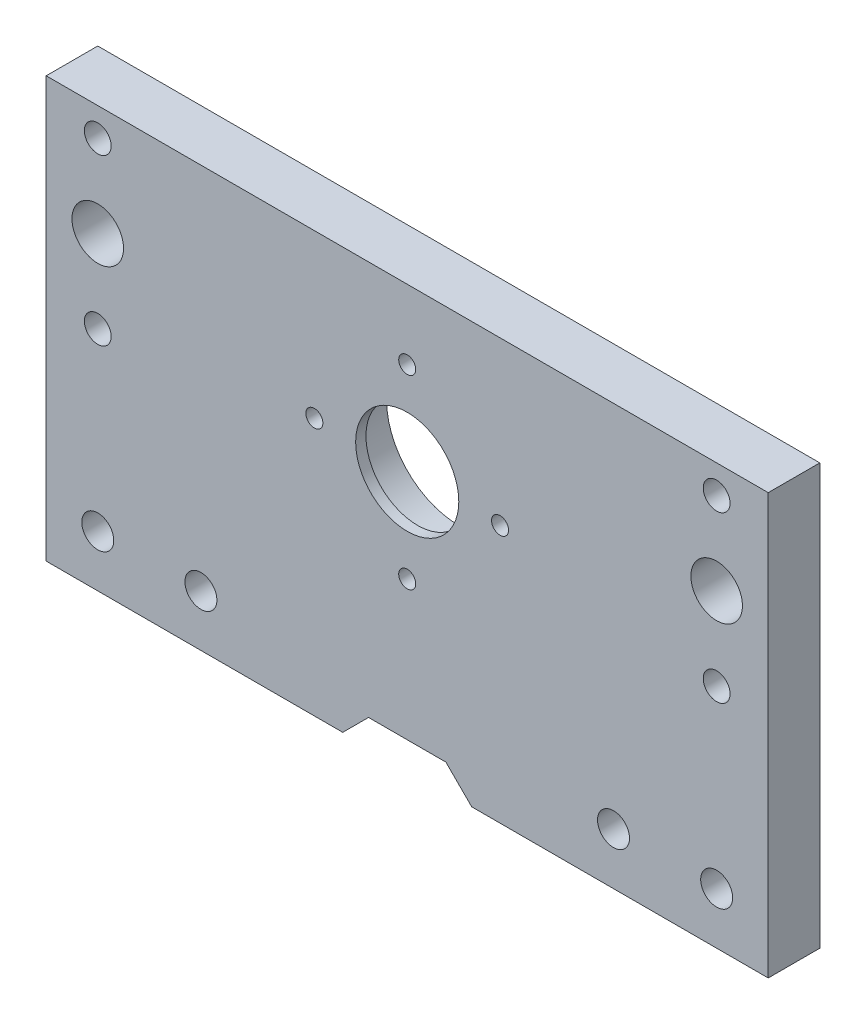
ISO-10303-21;
HEADER;
FILE_DESCRIPTION(('STEP AP214'),'2;1');
FILE_NAME('part.step','',(''),(''),'','','');
FILE_SCHEMA(('AUTOMOTIVE_DESIGN { 1 0 10303 214 1 1 1 1 }'));
ENDSEC;
DATA;
#1=APPLICATION_CONTEXT('core data for automotive mechanical design processes');
#2=APPLICATION_PROTOCOL_DEFINITION('international standard','automotive_design',2000,#1);
#3=PRODUCT_CONTEXT('',#1,'mechanical');
#4=PRODUCT('Part','Part','',(#3));
#5=PRODUCT_RELATED_PRODUCT_CATEGORY('part','',(#4));
#6=PRODUCT_DEFINITION_FORMATION('','',#4);
#7=PRODUCT_DEFINITION_CONTEXT('part definition',#1,'design');
#8=PRODUCT_DEFINITION('design','',#6,#7);
#9=PRODUCT_DEFINITION_SHAPE('','',#8);
#10=(LENGTH_UNIT() NAMED_UNIT(*) SI_UNIT(.MILLI.,.METRE.));
#11=(NAMED_UNIT(*) PLANE_ANGLE_UNIT() SI_UNIT($,.RADIAN.));
#12=(NAMED_UNIT(*) SI_UNIT($,.STERADIAN.) SOLID_ANGLE_UNIT());
#13=UNCERTAINTY_MEASURE_WITH_UNIT(LENGTH_MEASURE(1.E-05),#10,'distance_accuracy_value','');
#14=(GEOMETRIC_REPRESENTATION_CONTEXT(3) GLOBAL_UNCERTAINTY_ASSIGNED_CONTEXT((#13)) GLOBAL_UNIT_ASSIGNED_CONTEXT((#10,
#11,#12)) REPRESENTATION_CONTEXT('',''));
#15=CARTESIAN_POINT('',(0.,0.,0.));
#16=DIRECTION('',(0.,0.,1.));
#17=DIRECTION('',(1.,0.,0.));
#18=AXIS2_PLACEMENT_3D('',#15,#16,#17);
#19=CARTESIAN_POINT('',(0.,0.,0.));
#20=DIRECTION('',(0.,0.,1.));
#21=DIRECTION('',(1.,0.,0.));
#22=AXIS2_PLACEMENT_3D('',#19,#20,#21);
#23=PLANE('',#22);
#24=CARTESIAN_POINT('',(-18.,9.25000000000021,0.));
#25=DIRECTION('',(0.,0.,-1.));
#26=DIRECTION('',(-1.,0.,0.));
#27=AXIS2_PLACEMENT_3D('',#24,#25,#26);
#28=CIRCLE('',#27,1.65);
#29=CARTESIAN_POINT('',(-19.65,9.25000000000021,0.));
#30=VERTEX_POINT('',#29);
#31=EDGE_CURVE('E416',#30,#30,#28,.T.);
#32=ORIENTED_EDGE('',*,*,#31,.F.);
#33=EDGE_LOOP('',(#32));
#34=FACE_BOUND('',#33,.T.);
#35=CARTESIAN_POINT('',(0.,-8.74999999999998,0.));
#36=DIRECTION('',(0.,0.,-1.));
#37=DIRECTION('',(-1.,0.,0.));
#38=AXIS2_PLACEMENT_3D('',#35,#36,#37);
#39=CIRCLE('',#38,1.65);
#40=CARTESIAN_POINT('',(-1.65,-8.74999999999998,0.));
#41=VERTEX_POINT('',#40);
#42=EDGE_CURVE('E418',#41,#41,#39,.T.);
#43=ORIENTED_EDGE('',*,*,#42,.F.);
#44=EDGE_LOOP('',(#43));
#45=FACE_BOUND('',#44,.T.);
#46=CARTESIAN_POINT('',(0.,27.25,0.));
#47=DIRECTION('',(0.,0.,-1.));
#48=DIRECTION('',(-1.,0.,0.));
#49=AXIS2_PLACEMENT_3D('',#46,#47,#48);
#50=CIRCLE('',#49,1.65);
#51=CARTESIAN_POINT('',(-1.65,27.25,0.));
#52=VERTEX_POINT('',#51);
#53=EDGE_CURVE('E432',#52,#52,#50,.T.);
#54=ORIENTED_EDGE('',*,*,#53,.F.);
#55=EDGE_LOOP('',(#54));
#56=FACE_BOUND('',#55,.T.);
#57=CARTESIAN_POINT('',(-60.,3.25000000000004,0.));
#58=DIRECTION('',(0.,0.,-1.));
#59=DIRECTION('',(-1.,0.,0.));
#60=AXIS2_PLACEMENT_3D('',#57,#58,#59);
#61=CIRCLE('',#60,2.6);
#62=CARTESIAN_POINT('',(-62.6,3.25000000000004,0.));
#63=VERTEX_POINT('',#62);
#64=EDGE_CURVE('E465',#63,#63,#61,.T.);
#65=ORIENTED_EDGE('',*,*,#64,.F.);
#66=EDGE_LOOP('',(#65));
#67=FACE_BOUND('',#66,.T.);
#68=CARTESIAN_POINT('',(60.,-30.75,0.));
#69=DIRECTION('',(0.,0.,-1.));
#70=DIRECTION('',(-1.,0.,0.));
#71=AXIS2_PLACEMENT_3D('',#68,#69,#70);
#72=CIRCLE('',#71,3.1);
#73=CARTESIAN_POINT('',(56.9,-30.75,0.));
#74=VERTEX_POINT('',#73);
#75=EDGE_CURVE('E452',#74,#74,#72,.T.);
#76=ORIENTED_EDGE('',*,*,#75,.F.);
#77=EDGE_LOOP('',(#76));
#78=FACE_BOUND('',#77,.T.);
#79=CARTESIAN_POINT('',(40.,-30.75,0.));
#80=DIRECTION('',(0.,0.,-1.));
#81=DIRECTION('',(-1.,0.,0.));
#82=AXIS2_PLACEMENT_3D('',#79,#80,#81);
#83=CIRCLE('',#82,3.1);
#84=CARTESIAN_POINT('',(36.9,-30.75,0.));
#85=VERTEX_POINT('',#84);
#86=EDGE_CURVE('E453',#85,#85,#83,.T.);
#87=ORIENTED_EDGE('',*,*,#86,.F.);
#88=EDGE_LOOP('',(#87));
#89=FACE_BOUND('',#88,.T.);
#90=CARTESIAN_POINT('',(-40.,-30.75,0.));
#91=DIRECTION('',(0.,0.,-1.));
#92=DIRECTION('',(-1.,0.,0.));
#93=AXIS2_PLACEMENT_3D('',#90,#91,#92);
#94=CIRCLE('',#93,3.1);
#95=CARTESIAN_POINT('',(-43.1,-30.75,0.));
#96=VERTEX_POINT('',#95);
#97=EDGE_CURVE('E446',#96,#96,#94,.T.);
#98=ORIENTED_EDGE('',*,*,#97,.F.);
#99=EDGE_LOOP('',(#98));
#100=FACE_BOUND('',#99,.T.);
#101=CARTESIAN_POINT('',(-60.,19.25,0.));
#102=DIRECTION('',(0.,0.,-1.));
#103=DIRECTION('',(-1.,0.,0.));
#104=AXIS2_PLACEMENT_3D('',#101,#102,#103);
#105=CIRCLE('',#104,5.);
#106=CARTESIAN_POINT('',(-65.,19.25,0.));
#107=VERTEX_POINT('',#106);
#108=EDGE_CURVE('E489',#107,#107,#105,.T.);
#109=ORIENTED_EDGE('',*,*,#108,.F.);
#110=EDGE_LOOP('',(#109));
#111=FACE_BOUND('',#110,.T.);
#112=CARTESIAN_POINT('',(60.,35.25,0.));
#113=DIRECTION('',(0.,0.,-1.));
#114=DIRECTION('',(-1.,0.,0.));
#115=AXIS2_PLACEMENT_3D('',#112,#113,#114);
#116=CIRCLE('',#115,2.6);
#117=CARTESIAN_POINT('',(57.4,35.25,0.));
#118=VERTEX_POINT('',#117);
#119=EDGE_CURVE('E476',#118,#118,#116,.T.);
#120=ORIENTED_EDGE('',*,*,#119,.F.);
#121=EDGE_LOOP('',(#120));
#122=FACE_BOUND('',#121,.T.);
#123=CARTESIAN_POINT('',(60.,3.25000000000002,0.));
#124=DIRECTION('',(0.,0.,-1.));
#125=DIRECTION('',(-1.,0.,0.));
#126=AXIS2_PLACEMENT_3D('',#123,#124,#125);
#127=CIRCLE('',#126,2.6);
#128=CARTESIAN_POINT('',(57.4,3.25000000000002,0.));
#129=VERTEX_POINT('',#128);
#130=EDGE_CURVE('E477',#129,#129,#127,.T.);
#131=ORIENTED_EDGE('',*,*,#130,.F.);
#132=EDGE_LOOP('',(#131));
#133=FACE_BOUND('',#132,.T.);
#134=CARTESIAN_POINT('',(-60.,35.25,0.));
#135=DIRECTION('',(0.,0.,-1.));
#136=DIRECTION('',(-1.,0.,0.));
#137=AXIS2_PLACEMENT_3D('',#134,#135,#136);
#138=CIRCLE('',#137,2.6);
#139=CARTESIAN_POINT('',(-62.6,35.25,0.));
#140=VERTEX_POINT('',#139);
#141=EDGE_CURVE('E464',#140,#140,#138,.T.);
#142=ORIENTED_EDGE('',*,*,#141,.F.);
#143=EDGE_LOOP('',(#142));
#144=FACE_BOUND('',#143,.T.);
#145=CARTESIAN_POINT('',(-60.,-30.75,0.));
#146=DIRECTION('',(0.,0.,-1.));
#147=DIRECTION('',(-1.,0.,0.));
#148=AXIS2_PLACEMENT_3D('',#145,#146,#147);
#149=CIRCLE('',#148,3.09999999999999);
#150=CARTESIAN_POINT('',(-63.1,-30.75,0.));
#151=VERTEX_POINT('',#150);
#152=EDGE_CURVE('E441',#151,#151,#149,.T.);
#153=ORIENTED_EDGE('',*,*,#152,.F.);
#154=EDGE_LOOP('',(#153));
#155=FACE_BOUND('',#154,.T.);
#156=CARTESIAN_POINT('',(60.,19.25,0.));
#157=DIRECTION('',(0.,0.,-1.));
#158=DIRECTION('',(-1.,0.,0.));
#159=AXIS2_PLACEMENT_3D('',#156,#157,#158);
#160=CIRCLE('',#159,4.99999999999999);
#161=CARTESIAN_POINT('',(55.,19.25,0.));
#162=VERTEX_POINT('',#161);
#163=EDGE_CURVE('E488',#162,#162,#160,.T.);
#164=ORIENTED_EDGE('',*,*,#163,.F.);
#165=EDGE_LOOP('',(#164));
#166=FACE_BOUND('',#165,.T.);
#167=CARTESIAN_POINT('',(0.,9.25000000000002,0.));
#168=DIRECTION('',(0.,0.,-1.));
#169=DIRECTION('',(-1.,0.,0.));
#170=AXIS2_PLACEMENT_3D('',#167,#168,#169);
#171=CIRCLE('',#170,14.);
#172=CARTESIAN_POINT('',(-14.,9.25000000000002,0.));
#173=VERTEX_POINT('',#172);
#174=EDGE_CURVE('E500',#173,#173,#171,.T.);
#175=ORIENTED_EDGE('',*,*,#174,.F.);
#176=EDGE_LOOP('',(#175));
#177=FACE_BOUND('',#176,.T.);
#178=DIRECTION('',(1.,0.,0.));
#179=VECTOR('',#178,1.);
#180=CARTESIAN_POINT('',(-70.,-40.75,0.));
#181=LINE('',#180,#179);
#182=CARTESIAN_POINT('',(12.4999999999999,-40.75,0.));
#183=VERTEX_POINT('',#182);
#184=CARTESIAN_POINT('',(70.,-40.75,0.));
#185=VERTEX_POINT('',#184);
#186=EDGE_CURVE('E516',#183,#185,#181,.T.);
#187=ORIENTED_EDGE('',*,*,#186,.F.);
#188=DIRECTION('',(0.707106781186551,-0.707106781186544,0.));
#189=VECTOR('',#188,1.);
#190=CARTESIAN_POINT('',(-14.1250000000001,-14.1250000000003,0.));
#191=LINE('',#190,#189);
#192=CARTESIAN_POINT('',(7.49999999999983,-35.75,0.));
#193=VERTEX_POINT('',#192);
#194=EDGE_CURVE('E151',#183,#193,#191,.F.);
#195=ORIENTED_EDGE('',*,*,#194,.T.);
#196=DIRECTION('',(-1.,0.,0.));
#197=VECTOR('',#196,1.);
#198=CARTESIAN_POINT('',(-17.5,-35.75,0.));
#199=LINE('',#198,#197);
#200=CARTESIAN_POINT('',(-7.49999999999993,-35.75,0.));
#201=VERTEX_POINT('',#200);
#202=EDGE_CURVE('E164',#193,#201,#199,.T.);
#203=ORIENTED_EDGE('',*,*,#202,.T.);
#204=DIRECTION('',(0.707106781186544,0.707106781186551,0.));
#205=VECTOR('',#204,1.);
#206=CARTESIAN_POINT('',(14.125,-14.1249999999998,0.));
#207=LINE('',#206,#205);
#208=CARTESIAN_POINT('',(-12.4999999999999,-40.75,0.));
#209=VERTEX_POINT('',#208);
#210=EDGE_CURVE('E11',#201,#209,#207,.F.);
#211=ORIENTED_EDGE('',*,*,#210,.T.);
#212=CARTESIAN_POINT('',(-70.,-40.75,0.));
#213=VERTEX_POINT('',#212);
#214=EDGE_CURVE('E57',#213,#209,#181,.T.);
#215=ORIENTED_EDGE('',*,*,#214,.F.);
#216=DIRECTION('',(0.,-1.,0.));
#217=VECTOR('',#216,1.);
#218=CARTESIAN_POINT('',(-70.,40.75,0.));
#219=LINE('',#218,#217);
#220=CARTESIAN_POINT('',(-70.,40.75,0.));
#221=VERTEX_POINT('',#220);
#222=EDGE_CURVE('E514',#221,#213,#219,.T.);
#223=ORIENTED_EDGE('',*,*,#222,.F.);
#224=DIRECTION('',(-1.,0.,0.));
#225=VECTOR('',#224,1.);
#226=CARTESIAN_POINT('',(-70.,40.75,0.));
#227=LINE('',#226,#225);
#228=CARTESIAN_POINT('',(70.,40.75,0.));
#229=VERTEX_POINT('',#228);
#230=EDGE_CURVE('E512',#229,#221,#227,.T.);
#231=ORIENTED_EDGE('',*,*,#230,.F.);
#232=DIRECTION('',(0.,1.,0.));
#233=VECTOR('',#232,1.);
#234=CARTESIAN_POINT('',(70.,40.75,0.));
#235=LINE('',#234,#233);
#236=EDGE_CURVE('E136',#185,#229,#235,.T.);
#237=ORIENTED_EDGE('',*,*,#236,.F.);
#238=EDGE_LOOP('',(#187,#195,#203,#211,#215,#223,#231,#237));
#239=FACE_BOUND('',#238,.T.);
#240=CARTESIAN_POINT('',(18.,9.24999999999996,0.));
#241=DIRECTION('',(0.,0.,-1.));
#242=DIRECTION('',(-1.,0.,0.));
#243=AXIS2_PLACEMENT_3D('',#240,#241,#242);
#244=CIRCLE('',#243,1.65);
#245=CARTESIAN_POINT('',(16.35,9.24999999999996,0.));
#246=VERTEX_POINT('',#245);
#247=EDGE_CURVE('E426',#246,#246,#244,.T.);
#248=ORIENTED_EDGE('',*,*,#247,.F.);
#249=EDGE_LOOP('',(#248));
#250=FACE_BOUND('',#249,.T.);
#251=ADVANCED_FACE('F41',(#34,#45,#56,#67,#78,#89,#100,#111,#122,#133,#144,#155,#166,#177,#239,
#250),#23,.F.);
#252=CARTESIAN_POINT('',(-70.,-40.75,10.));
#253=DIRECTION('',(0.,1.,0.));
#254=DIRECTION('',(0.,0.,1.));
#255=AXIS2_PLACEMENT_3D('',#252,#253,#254);
#256=PLANE('',#255);
#257=ORIENTED_EDGE('',*,*,#214,.T.);
#258=DIRECTION('',(0.,0.,-1.));
#259=VECTOR('',#258,1.);
#260=CARTESIAN_POINT('',(-12.4999999999999,-40.75,10.));
#261=LINE('',#260,#259);
#262=CARTESIAN_POINT('',(-12.4999999999999,-40.75,10.));
#263=VERTEX_POINT('',#262);
#264=EDGE_CURVE('E153',#209,#263,#261,.F.);
#265=ORIENTED_EDGE('',*,*,#264,.T.);
#266=DIRECTION('',(1.,0.,0.));
#267=VECTOR('',#266,1.);
#268=CARTESIAN_POINT('',(-70.,-40.75,10.));
#269=LINE('',#268,#267);
#270=CARTESIAN_POINT('',(-70.,-40.75,10.));
#271=VERTEX_POINT('',#270);
#272=EDGE_CURVE('E65',#271,#263,#269,.T.);
#273=ORIENTED_EDGE('',*,*,#272,.F.);
#274=DIRECTION('',(0.,0.,-1.));
#275=VECTOR('',#274,1.);
#276=CARTESIAN_POINT('',(-70.,-40.75,10.));
#277=LINE('',#276,#275);
#278=EDGE_CURVE('E141',#271,#213,#277,.T.);
#279=ORIENTED_EDGE('',*,*,#278,.T.);
#280=EDGE_LOOP('',(#257,#265,#273,#279));
#281=FACE_BOUND('',#280,.T.);
#282=ADVANCED_FACE('F178',(#281),#256,.F.);
#283=CARTESIAN_POINT('',(70.,40.75,10.));
#284=DIRECTION('',(-1.,0.,0.));
#285=DIRECTION('',(0.,0.,1.));
#286=AXIS2_PLACEMENT_3D('',#283,#284,#285);
#287=PLANE('',#286);
#288=ORIENTED_EDGE('',*,*,#236,.T.);
#289=DIRECTION('',(0.,0.,-1.));
#290=VECTOR('',#289,1.);
#291=CARTESIAN_POINT('',(70.,40.75,10.));
#292=LINE('',#291,#290);
#293=CARTESIAN_POINT('',(70.,40.75,10.));
#294=VERTEX_POINT('',#293);
#295=EDGE_CURVE('E120',#294,#229,#292,.T.);
#296=ORIENTED_EDGE('',*,*,#295,.F.);
#297=DIRECTION('',(0.,1.,0.));
#298=VECTOR('',#297,1.);
#299=CARTESIAN_POINT('',(70.,40.75,10.));
#300=LINE('',#299,#298);
#301=CARTESIAN_POINT('',(70.,-40.75,10.));
#302=VERTEX_POINT('',#301);
#303=EDGE_CURVE('E126',#302,#294,#300,.T.);
#304=ORIENTED_EDGE('',*,*,#303,.F.);
#305=DIRECTION('',(0.,0.,-1.));
#306=VECTOR('',#305,1.);
#307=CARTESIAN_POINT('',(70.,-40.75,10.));
#308=LINE('',#307,#306);
#309=EDGE_CURVE('E510',#302,#185,#308,.T.);
#310=ORIENTED_EDGE('',*,*,#309,.T.);
#311=EDGE_LOOP('',(#288,#296,#304,#310));
#312=FACE_BOUND('',#311,.T.);
#313=ADVANCED_FACE('F134',(#312),#287,.F.);
#314=CARTESIAN_POINT('',(-70.,40.75,10.));
#315=DIRECTION('',(0.,-1.,0.));
#316=DIRECTION('',(0.,0.,-1.));
#317=AXIS2_PLACEMENT_3D('',#314,#315,#316);
#318=PLANE('',#317);
#319=ORIENTED_EDGE('',*,*,#230,.T.);
#320=DIRECTION('',(0.,0.,-1.));
#321=VECTOR('',#320,1.);
#322=CARTESIAN_POINT('',(-70.,40.75,10.));
#323=LINE('',#322,#321);
#324=CARTESIAN_POINT('',(-70.,40.75,10.));
#325=VERTEX_POINT('',#324);
#326=EDGE_CURVE('E123',#325,#221,#323,.T.);
#327=ORIENTED_EDGE('',*,*,#326,.F.);
#328=DIRECTION('',(-1.,0.,0.));
#329=VECTOR('',#328,1.);
#330=CARTESIAN_POINT('',(-70.,40.75,10.));
#331=LINE('',#330,#329);
#332=EDGE_CURVE('E116',#294,#325,#331,.T.);
#333=ORIENTED_EDGE('',*,*,#332,.F.);
#334=ORIENTED_EDGE('',*,*,#295,.T.);
#335=EDGE_LOOP('',(#319,#327,#333,#334));
#336=FACE_BOUND('',#335,.T.);
#337=ADVANCED_FACE('F118',(#336),#318,.F.);
#338=CARTESIAN_POINT('',(-70.,40.75,10.));
#339=DIRECTION('',(1.,0.,0.));
#340=DIRECTION('',(0.,0.,-1.));
#341=AXIS2_PLACEMENT_3D('',#338,#339,#340);
#342=PLANE('',#341);
#343=ORIENTED_EDGE('',*,*,#222,.T.);
#344=ORIENTED_EDGE('',*,*,#278,.F.);
#345=DIRECTION('',(0.,-1.,0.));
#346=VECTOR('',#345,1.);
#347=CARTESIAN_POINT('',(-70.,40.75,10.));
#348=LINE('',#347,#346);
#349=EDGE_CURVE('E125',#325,#271,#348,.T.);
#350=ORIENTED_EDGE('',*,*,#349,.F.);
#351=ORIENTED_EDGE('',*,*,#326,.T.);
#352=EDGE_LOOP('',(#343,#344,#350,#351));
#353=FACE_BOUND('',#352,.T.);
#354=ADVANCED_FACE('F192',(#353),#342,.F.);
#355=CARTESIAN_POINT('',(12.4999999999999,-40.75,10.));
#356=VERTEX_POINT('',#355);
#357=EDGE_CURVE('E76',#356,#302,#269,.T.);
#358=ORIENTED_EDGE('',*,*,#357,.F.);
#359=DIRECTION('',(0.,0.,1.));
#360=VECTOR('',#359,1.);
#361=CARTESIAN_POINT('',(12.4999999999999,-40.75,10.));
#362=LINE('',#361,#360);
#363=EDGE_CURVE('E149',#356,#183,#362,.F.);
#364=ORIENTED_EDGE('',*,*,#363,.T.);
#365=ORIENTED_EDGE('',*,*,#186,.T.);
#366=ORIENTED_EDGE('',*,*,#309,.F.);
#367=EDGE_LOOP('',(#358,#364,#365,#366));
#368=FACE_BOUND('',#367,.T.);
#369=ADVANCED_FACE('F185',(#368),#256,.F.);
#370=CARTESIAN_POINT('',(0.,0.,10.));
#371=DIRECTION('',(0.,0.,1.));
#372=DIRECTION('',(1.,0.,0.));
#373=AXIS2_PLACEMENT_3D('',#370,#371,#372);
#374=PLANE('',#373);
#375=CARTESIAN_POINT('',(-18.,9.25000000000021,10.));
#376=DIRECTION('',(0.,0.,1.));
#377=DIRECTION('',(1.,0.,0.));
#378=AXIS2_PLACEMENT_3D('',#375,#376,#377);
#379=CIRCLE('',#378,1.65);
#380=CARTESIAN_POINT('',(-16.35,9.25000000000021,10.));
#381=VERTEX_POINT('',#380);
#382=EDGE_CURVE('E414',#381,#381,#379,.T.);
#383=ORIENTED_EDGE('',*,*,#382,.F.);
#384=EDGE_LOOP('',(#383));
#385=FACE_BOUND('',#384,.T.);
#386=CARTESIAN_POINT('',(0.,-8.74999999999998,10.));
#387=DIRECTION('',(0.,0.,1.));
#388=DIRECTION('',(1.,0.,0.));
#389=AXIS2_PLACEMENT_3D('',#386,#387,#388);
#390=CIRCLE('',#389,1.65);
#391=CARTESIAN_POINT('',(1.65,-8.74999999999998,10.));
#392=VERTEX_POINT('',#391);
#393=EDGE_CURVE('E423',#392,#392,#390,.T.);
#394=ORIENTED_EDGE('',*,*,#393,.F.);
#395=EDGE_LOOP('',(#394));
#396=FACE_BOUND('',#395,.T.);
#397=CARTESIAN_POINT('',(18.,9.24999999999996,10.));
#398=DIRECTION('',(0.,0.,1.));
#399=DIRECTION('',(1.,0.,0.));
#400=AXIS2_PLACEMENT_3D('',#397,#398,#399);
#401=CIRCLE('',#400,1.65);
#402=CARTESIAN_POINT('',(19.65,9.24999999999996,10.));
#403=VERTEX_POINT('',#402);
#404=EDGE_CURVE('E429',#403,#403,#401,.T.);
#405=ORIENTED_EDGE('',*,*,#404,.F.);
#406=EDGE_LOOP('',(#405));
#407=FACE_BOUND('',#406,.T.);
#408=CARTESIAN_POINT('',(0.,27.25,10.));
#409=DIRECTION('',(0.,0.,1.));
#410=DIRECTION('',(1.,0.,0.));
#411=AXIS2_PLACEMENT_3D('',#408,#409,#410);
#412=CIRCLE('',#411,1.65);
#413=CARTESIAN_POINT('',(1.65,27.25,10.));
#414=VERTEX_POINT('',#413);
#415=EDGE_CURVE('E435',#414,#414,#412,.T.);
#416=ORIENTED_EDGE('',*,*,#415,.F.);
#417=EDGE_LOOP('',(#416));
#418=FACE_BOUND('',#417,.T.);
#419=CARTESIAN_POINT('',(0.,9.25000000000002,10.));
#420=DIRECTION('',(0.,0.,1.));
#421=DIRECTION('',(1.,0.,0.));
#422=AXIS2_PLACEMENT_3D('',#419,#420,#421);
#423=CIRCLE('',#422,10.);
#424=CARTESIAN_POINT('',(10.,9.25000000000002,10.));
#425=VERTEX_POINT('',#424);
#426=EDGE_CURVE('E45',#425,#425,#423,.T.);
#427=ORIENTED_EDGE('',*,*,#426,.F.);
#428=EDGE_LOOP('',(#427));
#429=FACE_BOUND('',#428,.T.);
#430=ORIENTED_EDGE('',*,*,#272,.T.);
#431=DIRECTION('',(-0.707106781186544,-0.707106781186551,0.));
#432=VECTOR('',#431,1.);
#433=CARTESIAN_POINT('',(-17.5,-45.7500000000002,10.));
#434=LINE('',#433,#432);
#435=CARTESIAN_POINT('',(-7.49999999999993,-35.75,10.));
#436=VERTEX_POINT('',#435);
#437=EDGE_CURVE('E50',#263,#436,#434,.F.);
#438=ORIENTED_EDGE('',*,*,#437,.T.);
#439=DIRECTION('',(-1.,0.,0.));
#440=VECTOR('',#439,1.);
#441=CARTESIAN_POINT('',(-17.5,-35.75,10.));
#442=LINE('',#441,#440);
#443=CARTESIAN_POINT('',(7.49999999999983,-35.75,10.));
#444=VERTEX_POINT('',#443);
#445=EDGE_CURVE('E158',#444,#436,#442,.T.);
#446=ORIENTED_EDGE('',*,*,#445,.F.);
#447=DIRECTION('',(-0.707106781186551,0.707106781186544,0.));
#448=VECTOR('',#447,1.);
#449=CARTESIAN_POINT('',(7.49999999999983,-35.75,10.));
#450=LINE('',#449,#448);
#451=EDGE_CURVE('E147',#444,#356,#450,.F.);
#452=ORIENTED_EDGE('',*,*,#451,.T.);
#453=ORIENTED_EDGE('',*,*,#357,.T.);
#454=ORIENTED_EDGE('',*,*,#303,.T.);
#455=ORIENTED_EDGE('',*,*,#332,.T.);
#456=ORIENTED_EDGE('',*,*,#349,.T.);
#457=EDGE_LOOP('',(#430,#438,#446,#452,#453,#454,#455,#456));
#458=FACE_BOUND('',#457,.T.);
#459=CARTESIAN_POINT('',(-60.,3.25000000000004,10.));
#460=DIRECTION('',(0.,0.,-1.));
#461=DIRECTION('',(-1.,0.,0.));
#462=AXIS2_PLACEMENT_3D('',#459,#460,#461);
#463=CIRCLE('',#462,2.6);
#464=CARTESIAN_POINT('',(-62.6,3.25000000000004,10.));
#465=VERTEX_POINT('',#464);
#466=EDGE_CURVE('E461',#465,#465,#463,.T.);
#467=ORIENTED_EDGE('',*,*,#466,.T.);
#468=EDGE_LOOP('',(#467));
#469=FACE_BOUND('',#468,.T.);
#470=CARTESIAN_POINT('',(60.,-30.75,10.));
#471=DIRECTION('',(0.,0.,-1.));
#472=DIRECTION('',(-1.,0.,0.));
#473=AXIS2_PLACEMENT_3D('',#470,#471,#472);
#474=CIRCLE('',#473,3.1);
#475=CARTESIAN_POINT('',(56.9,-30.75,10.));
#476=VERTEX_POINT('',#475);
#477=EDGE_CURVE('E468',#476,#476,#474,.T.);
#478=ORIENTED_EDGE('',*,*,#477,.T.);
#479=EDGE_LOOP('',(#478));
#480=FACE_BOUND('',#479,.T.);
#481=CARTESIAN_POINT('',(40.,-30.75,10.));
#482=DIRECTION('',(0.,0.,-1.));
#483=DIRECTION('',(-1.,0.,0.));
#484=AXIS2_PLACEMENT_3D('',#481,#482,#483);
#485=CIRCLE('',#484,3.1);
#486=CARTESIAN_POINT('',(36.9,-30.75,10.));
#487=VERTEX_POINT('',#486);
#488=EDGE_CURVE('E449',#487,#487,#485,.T.);
#489=ORIENTED_EDGE('',*,*,#488,.T.);
#490=EDGE_LOOP('',(#489));
#491=FACE_BOUND('',#490,.T.);
#492=CARTESIAN_POINT('',(-40.,-30.75,10.));
#493=DIRECTION('',(0.,0.,-1.));
#494=DIRECTION('',(-1.,0.,0.));
#495=AXIS2_PLACEMENT_3D('',#492,#493,#494);
#496=CIRCLE('',#495,3.1);
#497=CARTESIAN_POINT('',(-43.1,-30.75,10.));
#498=VERTEX_POINT('',#497);
#499=EDGE_CURVE('E456',#498,#498,#496,.T.);
#500=ORIENTED_EDGE('',*,*,#499,.T.);
#501=EDGE_LOOP('',(#500));
#502=FACE_BOUND('',#501,.T.);
#503=CARTESIAN_POINT('',(-60.,19.25,10.));
#504=DIRECTION('',(0.,0.,-1.));
#505=DIRECTION('',(-1.,0.,0.));
#506=AXIS2_PLACEMENT_3D('',#503,#504,#505);
#507=CIRCLE('',#506,5.);
#508=CARTESIAN_POINT('',(-65.,19.25,10.));
#509=VERTEX_POINT('',#508);
#510=EDGE_CURVE('E485',#509,#509,#507,.T.);
#511=ORIENTED_EDGE('',*,*,#510,.T.);
#512=EDGE_LOOP('',(#511));
#513=FACE_BOUND('',#512,.T.);
#514=CARTESIAN_POINT('',(60.,35.25,10.));
#515=DIRECTION('',(0.,0.,-1.));
#516=DIRECTION('',(-1.,0.,0.));
#517=AXIS2_PLACEMENT_3D('',#514,#515,#516);
#518=CIRCLE('',#517,2.6);
#519=CARTESIAN_POINT('',(57.4,35.25,10.));
#520=VERTEX_POINT('',#519);
#521=EDGE_CURVE('E492',#520,#520,#518,.T.);
#522=ORIENTED_EDGE('',*,*,#521,.T.);
#523=EDGE_LOOP('',(#522));
#524=FACE_BOUND('',#523,.T.);
#525=CARTESIAN_POINT('',(60.,3.25000000000002,10.));
#526=DIRECTION('',(0.,0.,-1.));
#527=DIRECTION('',(-1.,0.,0.));
#528=AXIS2_PLACEMENT_3D('',#525,#526,#527);
#529=CIRCLE('',#528,2.6);
#530=CARTESIAN_POINT('',(57.4,3.25000000000002,10.));
#531=VERTEX_POINT('',#530);
#532=EDGE_CURVE('E473',#531,#531,#529,.T.);
#533=ORIENTED_EDGE('',*,*,#532,.T.);
#534=EDGE_LOOP('',(#533));
#535=FACE_BOUND('',#534,.T.);
#536=CARTESIAN_POINT('',(-60.,35.25,10.));
#537=DIRECTION('',(0.,0.,-1.));
#538=DIRECTION('',(-1.,0.,0.));
#539=AXIS2_PLACEMENT_3D('',#536,#537,#538);
#540=CIRCLE('',#539,2.6);
#541=CARTESIAN_POINT('',(-62.6,35.25,10.));
#542=VERTEX_POINT('',#541);
#543=EDGE_CURVE('E480',#542,#542,#540,.T.);
#544=ORIENTED_EDGE('',*,*,#543,.T.);
#545=EDGE_LOOP('',(#544));
#546=FACE_BOUND('',#545,.T.);
#547=CARTESIAN_POINT('',(-60.,-30.75,10.));
#548=DIRECTION('',(0.,0.,-1.));
#549=DIRECTION('',(-1.,0.,0.));
#550=AXIS2_PLACEMENT_3D('',#547,#548,#549);
#551=CIRCLE('',#550,3.09999999999999);
#552=CARTESIAN_POINT('',(-63.1,-30.75,10.));
#553=VERTEX_POINT('',#552);
#554=EDGE_CURVE('E443',#553,#553,#551,.T.);
#555=ORIENTED_EDGE('',*,*,#554,.T.);
#556=EDGE_LOOP('',(#555));
#557=FACE_BOUND('',#556,.T.);
#558=CARTESIAN_POINT('',(60.,19.25,10.));
#559=DIRECTION('',(0.,0.,-1.));
#560=DIRECTION('',(-1.,0.,0.));
#561=AXIS2_PLACEMENT_3D('',#558,#559,#560);
#562=CIRCLE('',#561,4.99999999999999);
#563=CARTESIAN_POINT('',(55.,19.25,10.));
#564=VERTEX_POINT('',#563);
#565=EDGE_CURVE('E497',#564,#564,#562,.T.);
#566=ORIENTED_EDGE('',*,*,#565,.T.);
#567=EDGE_LOOP('',(#566));
#568=FACE_BOUND('',#567,.T.);
#569=ADVANCED_FACE('F129',(#385,#396,#407,#418,#429,#458,#469,#480,#491,#502,#513,#524,#535,
#546,#557,#568),#374,.T.);
#570=CARTESIAN_POINT('',(0.,9.25000000000002,8.));
#571=DIRECTION('',(0.,0.,-1.));
#572=DIRECTION('',(-1.,0.,0.));
#573=AXIS2_PLACEMENT_3D('',#570,#571,#572);
#574=CYLINDRICAL_SURFACE('',#573,14.);
#575=CARTESIAN_POINT('',(0.,9.25000000000002,8.));
#576=DIRECTION('',(0.,0.,-1.));
#577=DIRECTION('',(-1.,0.,0.));
#578=AXIS2_PLACEMENT_3D('',#575,#576,#577);
#579=CIRCLE('',#578,14.);
#580=CARTESIAN_POINT('',(-14.,9.25000000000002,8.));
#581=VERTEX_POINT('',#580);
#582=EDGE_CURVE('E503',#581,#581,#579,.T.);
#583=ORIENTED_EDGE('',*,*,#582,.F.);
#584=EDGE_LOOP('',(#583));
#585=FACE_BOUND('',#584,.T.);
#586=ORIENTED_EDGE('',*,*,#174,.T.);
#587=EDGE_LOOP('',(#586));
#588=FACE_BOUND('',#587,.T.);
#589=ADVANCED_FACE('F223',(#585,#588),#574,.F.);
#590=CARTESIAN_POINT('',(0.,9.25000000000002,8.));
#591=DIRECTION('',(0.,0.,-1.));
#592=DIRECTION('',(-1.,0.,0.));
#593=AXIS2_PLACEMENT_3D('',#590,#591,#592);
#594=PLANE('',#593);
#595=CARTESIAN_POINT('',(0.,9.25000000000002,8.));
#596=DIRECTION('',(0.,0.,-1.));
#597=DIRECTION('',(-1.,0.,0.));
#598=AXIS2_PLACEMENT_3D('',#595,#596,#597);
#599=CIRCLE('',#598,10.);
#600=CARTESIAN_POINT('',(-10.,9.25000000000002,8.));
#601=VERTEX_POINT('',#600);
#602=EDGE_CURVE('E438',#601,#601,#599,.T.);
#603=ORIENTED_EDGE('',*,*,#602,.F.);
#604=EDGE_LOOP('',(#603));
#605=FACE_BOUND('',#604,.T.);
#606=ORIENTED_EDGE('',*,*,#582,.T.);
#607=EDGE_LOOP('',(#606));
#608=FACE_BOUND('',#607,.T.);
#609=ADVANCED_FACE('F231',(#605,#608),#594,.T.);
#610=CARTESIAN_POINT('',(60.,19.25,10.));
#611=DIRECTION('',(0.,0.,-1.));
#612=DIRECTION('',(-1.,0.,0.));
#613=AXIS2_PLACEMENT_3D('',#610,#611,#612);
#614=CYLINDRICAL_SURFACE('',#613,4.99999999999999);
#615=ORIENTED_EDGE('',*,*,#565,.F.);
#616=EDGE_LOOP('',(#615));
#617=FACE_BOUND('',#616,.T.);
#618=ORIENTED_EDGE('',*,*,#163,.T.);
#619=EDGE_LOOP('',(#618));
#620=FACE_BOUND('',#619,.T.);
#621=ADVANCED_FACE('F239',(#617,#620),#614,.F.);
#622=CARTESIAN_POINT('',(-60.,-30.75,10.));
#623=DIRECTION('',(0.,0.,-1.));
#624=DIRECTION('',(-1.,0.,0.));
#625=AXIS2_PLACEMENT_3D('',#622,#623,#624);
#626=CYLINDRICAL_SURFACE('',#625,3.09999999999999);
#627=ORIENTED_EDGE('',*,*,#554,.F.);
#628=EDGE_LOOP('',(#627));
#629=FACE_BOUND('',#628,.T.);
#630=ORIENTED_EDGE('',*,*,#152,.T.);
#631=EDGE_LOOP('',(#630));
#632=FACE_BOUND('',#631,.T.);
#633=ADVANCED_FACE('F247',(#629,#632),#626,.F.);
#634=CARTESIAN_POINT('',(-60.,35.25,10.));
#635=DIRECTION('',(0.,0.,-1.));
#636=DIRECTION('',(-1.,0.,0.));
#637=AXIS2_PLACEMENT_3D('',#634,#635,#636);
#638=CYLINDRICAL_SURFACE('',#637,2.6);
#639=ORIENTED_EDGE('',*,*,#543,.F.);
#640=EDGE_LOOP('',(#639));
#641=FACE_BOUND('',#640,.T.);
#642=ORIENTED_EDGE('',*,*,#141,.T.);
#643=EDGE_LOOP('',(#642));
#644=FACE_BOUND('',#643,.T.);
#645=ADVANCED_FACE('F255',(#641,#644),#638,.F.);
#646=CARTESIAN_POINT('',(60.,3.25000000000002,10.));
#647=DIRECTION('',(0.,0.,-1.));
#648=DIRECTION('',(-1.,0.,0.));
#649=AXIS2_PLACEMENT_3D('',#646,#647,#648);
#650=CYLINDRICAL_SURFACE('',#649,2.6);
#651=ORIENTED_EDGE('',*,*,#532,.F.);
#652=EDGE_LOOP('',(#651));
#653=FACE_BOUND('',#652,.T.);
#654=ORIENTED_EDGE('',*,*,#130,.T.);
#655=EDGE_LOOP('',(#654));
#656=FACE_BOUND('',#655,.T.);
#657=ADVANCED_FACE('F263',(#653,#656),#650,.F.);
#658=CARTESIAN_POINT('',(60.,35.25,10.));
#659=DIRECTION('',(0.,0.,-1.));
#660=DIRECTION('',(-1.,0.,0.));
#661=AXIS2_PLACEMENT_3D('',#658,#659,#660);
#662=CYLINDRICAL_SURFACE('',#661,2.6);
#663=ORIENTED_EDGE('',*,*,#521,.F.);
#664=EDGE_LOOP('',(#663));
#665=FACE_BOUND('',#664,.T.);
#666=ORIENTED_EDGE('',*,*,#119,.T.);
#667=EDGE_LOOP('',(#666));
#668=FACE_BOUND('',#667,.T.);
#669=ADVANCED_FACE('F271',(#665,#668),#662,.F.);
#670=CARTESIAN_POINT('',(-60.,19.25,10.));
#671=DIRECTION('',(0.,0.,-1.));
#672=DIRECTION('',(-1.,0.,0.));
#673=AXIS2_PLACEMENT_3D('',#670,#671,#672);
#674=CYLINDRICAL_SURFACE('',#673,5.);
#675=ORIENTED_EDGE('',*,*,#510,.F.);
#676=EDGE_LOOP('',(#675));
#677=FACE_BOUND('',#676,.T.);
#678=ORIENTED_EDGE('',*,*,#108,.T.);
#679=EDGE_LOOP('',(#678));
#680=FACE_BOUND('',#679,.T.);
#681=ADVANCED_FACE('F279',(#677,#680),#674,.F.);
#682=CARTESIAN_POINT('',(-40.,-30.75,10.));
#683=DIRECTION('',(0.,0.,-1.));
#684=DIRECTION('',(-1.,0.,0.));
#685=AXIS2_PLACEMENT_3D('',#682,#683,#684);
#686=CYLINDRICAL_SURFACE('',#685,3.1);
#687=ORIENTED_EDGE('',*,*,#499,.F.);
#688=EDGE_LOOP('',(#687));
#689=FACE_BOUND('',#688,.T.);
#690=ORIENTED_EDGE('',*,*,#97,.T.);
#691=EDGE_LOOP('',(#690));
#692=FACE_BOUND('',#691,.T.);
#693=ADVANCED_FACE('F287',(#689,#692),#686,.F.);
#694=CARTESIAN_POINT('',(40.,-30.75,10.));
#695=DIRECTION('',(0.,0.,-1.));
#696=DIRECTION('',(-1.,0.,0.));
#697=AXIS2_PLACEMENT_3D('',#694,#695,#696);
#698=CYLINDRICAL_SURFACE('',#697,3.1);
#699=ORIENTED_EDGE('',*,*,#488,.F.);
#700=EDGE_LOOP('',(#699));
#701=FACE_BOUND('',#700,.T.);
#702=ORIENTED_EDGE('',*,*,#86,.T.);
#703=EDGE_LOOP('',(#702));
#704=FACE_BOUND('',#703,.T.);
#705=ADVANCED_FACE('F295',(#701,#704),#698,.F.);
#706=CARTESIAN_POINT('',(60.,-30.75,10.));
#707=DIRECTION('',(0.,0.,-1.));
#708=DIRECTION('',(-1.,0.,0.));
#709=AXIS2_PLACEMENT_3D('',#706,#707,#708);
#710=CYLINDRICAL_SURFACE('',#709,3.1);
#711=ORIENTED_EDGE('',*,*,#477,.F.);
#712=EDGE_LOOP('',(#711));
#713=FACE_BOUND('',#712,.T.);
#714=ORIENTED_EDGE('',*,*,#75,.T.);
#715=EDGE_LOOP('',(#714));
#716=FACE_BOUND('',#715,.T.);
#717=ADVANCED_FACE('F303',(#713,#716),#710,.F.);
#718=CARTESIAN_POINT('',(-60.,3.25000000000004,10.));
#719=DIRECTION('',(0.,0.,-1.));
#720=DIRECTION('',(-1.,0.,0.));
#721=AXIS2_PLACEMENT_3D('',#718,#719,#720);
#722=CYLINDRICAL_SURFACE('',#721,2.6);
#723=ORIENTED_EDGE('',*,*,#466,.F.);
#724=EDGE_LOOP('',(#723));
#725=FACE_BOUND('',#724,.T.);
#726=ORIENTED_EDGE('',*,*,#64,.T.);
#727=EDGE_LOOP('',(#726));
#728=FACE_BOUND('',#727,.T.);
#729=ADVANCED_FACE('F311',(#725,#728),#722,.F.);
#730=CARTESIAN_POINT('',(-17.5,-35.75,0.));
#731=DIRECTION('',(0.,1.,0.));
#732=DIRECTION('',(-1.,0.,0.));
#733=AXIS2_PLACEMENT_3D('',#730,#731,#732);
#734=PLANE('',#733);
#735=ORIENTED_EDGE('',*,*,#202,.F.);
#736=DIRECTION('',(0.,0.,1.));
#737=VECTOR('',#736,1.);
#738=CARTESIAN_POINT('',(7.49999999999983,-35.75,10.));
#739=LINE('',#738,#737);
#740=EDGE_CURVE('E139',#193,#444,#739,.T.);
#741=ORIENTED_EDGE('',*,*,#740,.T.);
#742=ORIENTED_EDGE('',*,*,#445,.T.);
#743=DIRECTION('',(0.,0.,-1.));
#744=VECTOR('',#743,1.);
#745=CARTESIAN_POINT('',(-7.49999999999993,-35.75,0.));
#746=LINE('',#745,#744);
#747=EDGE_CURVE('E137',#436,#201,#746,.T.);
#748=ORIENTED_EDGE('',*,*,#747,.T.);
#749=EDGE_LOOP('',(#735,#741,#742,#748));
#750=FACE_BOUND('',#749,.T.);
#751=ADVANCED_FACE('F161',(#750),#734,.F.);
#752=CARTESIAN_POINT('',(7.49999999999983,-35.75,0.));
#753=DIRECTION('',(-0.707106781186544,-0.707106781186551,0.));
#754=DIRECTION('',(0.,0.,-1.));
#755=AXIS2_PLACEMENT_3D('',#752,#753,#754);
#756=PLANE('',#755);
#757=ORIENTED_EDGE('',*,*,#194,.F.);
#758=ORIENTED_EDGE('',*,*,#363,.F.);
#759=ORIENTED_EDGE('',*,*,#451,.F.);
#760=ORIENTED_EDGE('',*,*,#740,.F.);
#761=EDGE_LOOP('',(#757,#758,#759,#760));
#762=FACE_BOUND('',#761,.T.);
#763=ADVANCED_FACE('F168',(#762),#756,.T.);
#764=CARTESIAN_POINT('',(-17.5,-45.7500000000002,0.));
#765=DIRECTION('',(0.707106781186551,-0.707106781186544,0.));
#766=DIRECTION('',(0.,0.,-1.));
#767=AXIS2_PLACEMENT_3D('',#764,#765,#766);
#768=PLANE('',#767);
#769=ORIENTED_EDGE('',*,*,#210,.F.);
#770=ORIENTED_EDGE('',*,*,#747,.F.);
#771=ORIENTED_EDGE('',*,*,#437,.F.);
#772=ORIENTED_EDGE('',*,*,#264,.F.);
#773=EDGE_LOOP('',(#769,#770,#771,#772));
#774=FACE_BOUND('',#773,.T.);
#775=ADVANCED_FACE('F43',(#774),#768,.T.);
#776=CARTESIAN_POINT('',(0.,9.25000000000002,11.));
#777=DIRECTION('',(0.,0.,-1.));
#778=DIRECTION('',(-1.,0.,0.));
#779=AXIS2_PLACEMENT_3D('',#776,#777,#778);
#780=CYLINDRICAL_SURFACE('',#779,10.);
#781=ORIENTED_EDGE('',*,*,#426,.T.);
#782=EDGE_LOOP('',(#781));
#783=FACE_BOUND('',#782,.T.);
#784=ORIENTED_EDGE('',*,*,#602,.T.);
#785=EDGE_LOOP('',(#784));
#786=FACE_BOUND('',#785,.T.);
#787=ADVANCED_FACE('F167',(#783,#786),#780,.F.);
#788=CARTESIAN_POINT('',(0.,27.25,0.));
#789=DIRECTION('',(0.,0.,-1.));
#790=DIRECTION('',(-1.,0.,0.));
#791=AXIS2_PLACEMENT_3D('',#788,#789,#790);
#792=CYLINDRICAL_SURFACE('',#791,1.65);
#793=ORIENTED_EDGE('',*,*,#415,.T.);
#794=EDGE_LOOP('',(#793));
#795=FACE_BOUND('',#794,.T.);
#796=ORIENTED_EDGE('',*,*,#53,.T.);
#797=EDGE_LOOP('',(#796));
#798=FACE_BOUND('',#797,.T.);
#799=ADVANCED_FACE('F173',(#795,#798),#792,.F.);
#800=CARTESIAN_POINT('',(18.,9.24999999999996,0.));
#801=DIRECTION('',(0.,0.,-1.));
#802=DIRECTION('',(-1.,0.,0.));
#803=AXIS2_PLACEMENT_3D('',#800,#801,#802);
#804=CYLINDRICAL_SURFACE('',#803,1.65);
#805=ORIENTED_EDGE('',*,*,#404,.T.);
#806=EDGE_LOOP('',(#805));
#807=FACE_BOUND('',#806,.T.);
#808=ORIENTED_EDGE('',*,*,#247,.T.);
#809=EDGE_LOOP('',(#808));
#810=FACE_BOUND('',#809,.T.);
#811=ADVANCED_FACE('F347',(#807,#810),#804,.F.);
#812=CARTESIAN_POINT('',(0.,-8.74999999999998,0.));
#813=DIRECTION('',(0.,0.,-1.));
#814=DIRECTION('',(-1.,0.,0.));
#815=AXIS2_PLACEMENT_3D('',#812,#813,#814);
#816=CYLINDRICAL_SURFACE('',#815,1.65);
#817=ORIENTED_EDGE('',*,*,#393,.T.);
#818=EDGE_LOOP('',(#817));
#819=FACE_BOUND('',#818,.T.);
#820=ORIENTED_EDGE('',*,*,#42,.T.);
#821=EDGE_LOOP('',(#820));
#822=FACE_BOUND('',#821,.T.);
#823=ADVANCED_FACE('F365',(#819,#822),#816,.F.);
#824=CARTESIAN_POINT('',(-18.,9.25000000000021,0.));
#825=DIRECTION('',(0.,0.,-1.));
#826=DIRECTION('',(-1.,0.,0.));
#827=AXIS2_PLACEMENT_3D('',#824,#825,#826);
#828=CYLINDRICAL_SURFACE('',#827,1.65);
#829=ORIENTED_EDGE('',*,*,#382,.T.);
#830=EDGE_LOOP('',(#829));
#831=FACE_BOUND('',#830,.T.);
#832=ORIENTED_EDGE('',*,*,#31,.T.);
#833=EDGE_LOOP('',(#832));
#834=FACE_BOUND('',#833,.T.);
#835=ADVANCED_FACE('F375',(#831,#834),#828,.F.);
#836=CLOSED_SHELL('',(#251,#282,#313,#337,#354,#369,#569,#589,#609,#621,#633,#645,#657,#669,
#681,#693,#705,#717,#729,#751,#763,#775,#787,#799,#811,#823,#835));
#837=MANIFOLD_SOLID_BREP('B2',#836);
#838=ADVANCED_BREP_SHAPE_REPRESENTATION('',(#18,#837),#14);
#839=SHAPE_DEFINITION_REPRESENTATION(#9,#838);
ENDSEC;
END-ISO-10303-21;
